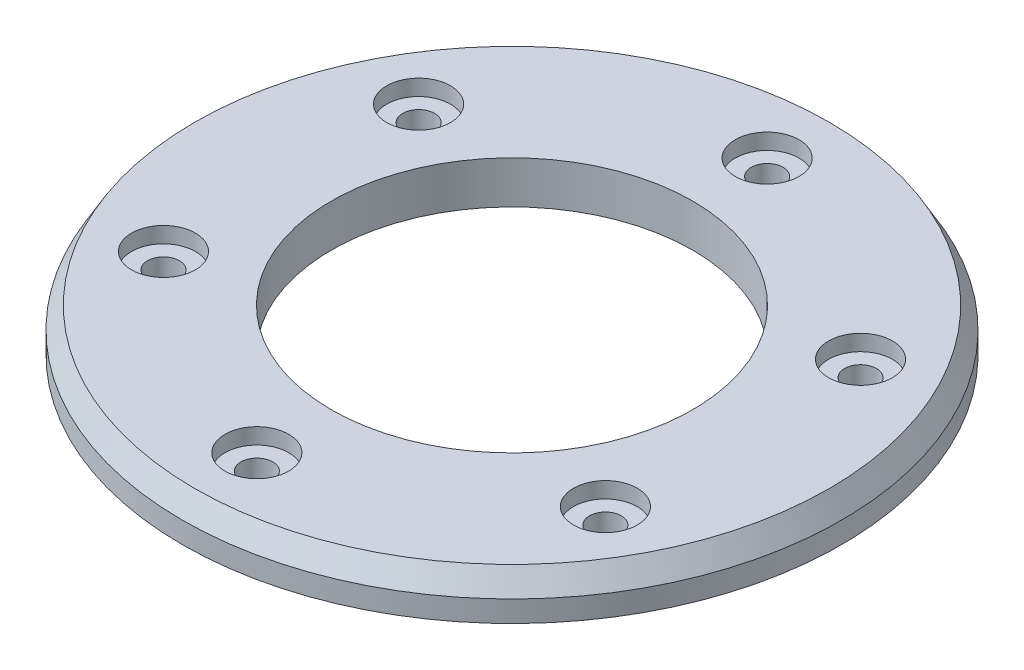
ISO-10303-21;
HEADER;
FILE_DESCRIPTION(('STEP AP214'),'2;1');
FILE_NAME('part.step','',(''),(''),'','','');
FILE_SCHEMA(('AUTOMOTIVE_DESIGN { 1 0 10303 214 1 1 1 1 }'));
ENDSEC;
DATA;
#1=APPLICATION_CONTEXT('core data for automotive mechanical design processes');
#2=APPLICATION_PROTOCOL_DEFINITION('international standard','automotive_design',2000,#1);
#3=PRODUCT_CONTEXT('',#1,'mechanical');
#4=PRODUCT('Part','Part','',(#3));
#5=PRODUCT_RELATED_PRODUCT_CATEGORY('part','',(#4));
#6=PRODUCT_DEFINITION_FORMATION('','',#4);
#7=PRODUCT_DEFINITION_CONTEXT('part definition',#1,'design');
#8=PRODUCT_DEFINITION('design','',#6,#7);
#9=PRODUCT_DEFINITION_SHAPE('','',#8);
#10=(LENGTH_UNIT() NAMED_UNIT(*) SI_UNIT(.MILLI.,.METRE.));
#11=(NAMED_UNIT(*) PLANE_ANGLE_UNIT() SI_UNIT($,.RADIAN.));
#12=(NAMED_UNIT(*) SI_UNIT($,.STERADIAN.) SOLID_ANGLE_UNIT());
#13=UNCERTAINTY_MEASURE_WITH_UNIT(LENGTH_MEASURE(1.E-05),#10,'distance_accuracy_value','');
#14=(GEOMETRIC_REPRESENTATION_CONTEXT(3) GLOBAL_UNCERTAINTY_ASSIGNED_CONTEXT((#13)) GLOBAL_UNIT_ASSIGNED_CONTEXT((#10,
#11,#12)) REPRESENTATION_CONTEXT('',''));
#15=CARTESIAN_POINT('',(0.,0.,0.));
#16=DIRECTION('',(0.,0.,1.));
#17=DIRECTION('',(1.,0.,0.));
#18=AXIS2_PLACEMENT_3D('',#15,#16,#17);
#19=CARTESIAN_POINT('',(0.,4.,-24.));
#20=DIRECTION('',(0.,-1.,0.));
#21=DIRECTION('',(0.,0.,-1.));
#22=AXIS2_PLACEMENT_3D('',#19,#20,#21);
#23=CYLINDRICAL_SURFACE('',#22,1.5);
#24=CARTESIAN_POINT('',(0.,0.,-24.));
#25=DIRECTION('',(0.,1.,0.));
#26=DIRECTION('',(0.,0.,1.));
#27=AXIS2_PLACEMENT_3D('',#24,#25,#26);
#28=CIRCLE('',#27,1.5);
#29=CARTESIAN_POINT('',(0.,0.,-22.5));
#30=VERTEX_POINT('',#29);
#31=EDGE_CURVE('E75',#30,#30,#28,.T.);
#32=ORIENTED_EDGE('',*,*,#31,.F.);
#33=EDGE_LOOP('',(#32));
#34=FACE_BOUND('',#33,.T.);
#35=CARTESIAN_POINT('',(0.,2.5,-24.));
#36=DIRECTION('',(0.,1.,0.));
#37=DIRECTION('',(0.,0.,1.));
#38=AXIS2_PLACEMENT_3D('',#35,#36,#37);
#39=CIRCLE('',#38,1.5);
#40=CARTESIAN_POINT('',(0.,2.5,-22.5));
#41=VERTEX_POINT('',#40);
#42=EDGE_CURVE('E52',#41,#41,#39,.T.);
#43=ORIENTED_EDGE('',*,*,#42,.T.);
#44=EDGE_LOOP('',(#43));
#45=FACE_BOUND('',#44,.T.);
#46=ADVANCED_FACE('F34',(#34,#45),#23,.F.);
#47=CARTESIAN_POINT('',(20.7846096908276,4.,-12.0000000000018));
#48=DIRECTION('',(0.,-1.,0.));
#49=DIRECTION('',(0.,0.,-1.));
#50=AXIS2_PLACEMENT_3D('',#47,#48,#49);
#51=CYLINDRICAL_SURFACE('',#50,1.5);
#52=CARTESIAN_POINT('',(20.7846096908276,0.,-12.0000000000018));
#53=DIRECTION('',(0.,1.,0.));
#54=DIRECTION('',(0.,0.,1.));
#55=AXIS2_PLACEMENT_3D('',#52,#53,#54);
#56=CIRCLE('',#55,1.5);
#57=CARTESIAN_POINT('',(20.7846096908276,0.,-10.5000000000018));
#58=VERTEX_POINT('',#57);
#59=EDGE_CURVE('E80',#58,#58,#56,.T.);
#60=ORIENTED_EDGE('',*,*,#59,.F.);
#61=EDGE_LOOP('',(#60));
#62=FACE_BOUND('',#61,.T.);
#63=CARTESIAN_POINT('',(20.7846096908276,2.5,-12.0000000000018));
#64=DIRECTION('',(0.,1.,0.));
#65=DIRECTION('',(0.,0.,1.));
#66=AXIS2_PLACEMENT_3D('',#63,#64,#65);
#67=CIRCLE('',#66,1.5);
#68=CARTESIAN_POINT('',(20.7846096908276,2.5,-10.5000000000018));
#69=VERTEX_POINT('',#68);
#70=EDGE_CURVE('E56',#69,#69,#67,.T.);
#71=ORIENTED_EDGE('',*,*,#70,.T.);
#72=EDGE_LOOP('',(#71));
#73=FACE_BOUND('',#72,.T.);
#74=ADVANCED_FACE('F201',(#62,#73),#51,.F.);
#75=CARTESIAN_POINT('',(20.7846096908297,4.,11.9999999999982));
#76=DIRECTION('',(0.,-1.,0.));
#77=DIRECTION('',(0.,0.,-1.));
#78=AXIS2_PLACEMENT_3D('',#75,#76,#77);
#79=CYLINDRICAL_SURFACE('',#78,1.5);
#80=CARTESIAN_POINT('',(20.7846096908297,0.,11.9999999999982));
#81=DIRECTION('',(0.,1.,0.));
#82=DIRECTION('',(0.,0.,1.));
#83=AXIS2_PLACEMENT_3D('',#80,#81,#82);
#84=CIRCLE('',#83,1.5);
#85=CARTESIAN_POINT('',(20.7846096908297,0.,13.4999999999982));
#86=VERTEX_POINT('',#85);
#87=EDGE_CURVE('E83',#86,#86,#84,.T.);
#88=ORIENTED_EDGE('',*,*,#87,.F.);
#89=EDGE_LOOP('',(#88));
#90=FACE_BOUND('',#89,.T.);
#91=CARTESIAN_POINT('',(20.7846096908297,2.5,11.9999999999982));
#92=DIRECTION('',(0.,1.,0.));
#93=DIRECTION('',(0.,0.,1.));
#94=AXIS2_PLACEMENT_3D('',#91,#92,#93);
#95=CIRCLE('',#94,1.5);
#96=CARTESIAN_POINT('',(20.7846096908297,2.5,13.4999999999982));
#97=VERTEX_POINT('',#96);
#98=EDGE_CURVE('E59',#97,#97,#95,.T.);
#99=ORIENTED_EDGE('',*,*,#98,.T.);
#100=EDGE_LOOP('',(#99));
#101=FACE_BOUND('',#100,.T.);
#102=ADVANCED_FACE('F207',(#90,#101),#79,.F.);
#103=CARTESIAN_POINT('',(4.17192928461361E-12,4.,24.));
#104=DIRECTION('',(0.,-1.,0.));
#105=DIRECTION('',(0.,0.,-1.));
#106=AXIS2_PLACEMENT_3D('',#103,#104,#105);
#107=CYLINDRICAL_SURFACE('',#106,1.5);
#108=CARTESIAN_POINT('',(4.17192928461361E-12,0.,24.));
#109=DIRECTION('',(0.,1.,0.));
#110=DIRECTION('',(0.,0.,1.));
#111=AXIS2_PLACEMENT_3D('',#108,#109,#110);
#112=CIRCLE('',#111,1.5);
#113=CARTESIAN_POINT('',(4.17192928461361E-12,0.,25.5));
#114=VERTEX_POINT('',#113);
#115=EDGE_CURVE('E86',#114,#114,#112,.T.);
#116=ORIENTED_EDGE('',*,*,#115,.F.);
#117=EDGE_LOOP('',(#116));
#118=FACE_BOUND('',#117,.T.);
#119=CARTESIAN_POINT('',(4.17192928461361E-12,2.5,24.));
#120=DIRECTION('',(0.,1.,0.));
#121=DIRECTION('',(0.,0.,1.));
#122=AXIS2_PLACEMENT_3D('',#119,#120,#121);
#123=CIRCLE('',#122,1.5);
#124=CARTESIAN_POINT('',(4.17192928461361E-12,2.5,25.5));
#125=VERTEX_POINT('',#124);
#126=EDGE_CURVE('E62',#125,#125,#123,.T.);
#127=ORIENTED_EDGE('',*,*,#126,.T.);
#128=EDGE_LOOP('',(#127));
#129=FACE_BOUND('',#128,.T.);
#130=ADVANCED_FACE('F248',(#118,#129),#107,.F.);
#131=CARTESIAN_POINT('',(-20.7846096908234,4.,12.0000000000018));
#132=DIRECTION('',(0.,-1.,0.));
#133=DIRECTION('',(0.,0.,-1.));
#134=AXIS2_PLACEMENT_3D('',#131,#132,#133);
#135=CYLINDRICAL_SURFACE('',#134,1.5);
#136=CARTESIAN_POINT('',(-20.7846096908234,0.,12.0000000000018));
#137=DIRECTION('',(0.,1.,0.));
#138=DIRECTION('',(0.,0.,1.));
#139=AXIS2_PLACEMENT_3D('',#136,#137,#138);
#140=CIRCLE('',#139,1.5);
#141=CARTESIAN_POINT('',(-20.7846096908234,0.,13.5000000000018));
#142=VERTEX_POINT('',#141);
#143=EDGE_CURVE('E89',#142,#142,#140,.T.);
#144=ORIENTED_EDGE('',*,*,#143,.F.);
#145=EDGE_LOOP('',(#144));
#146=FACE_BOUND('',#145,.T.);
#147=CARTESIAN_POINT('',(-20.7846096908234,2.5,12.0000000000018));
#148=DIRECTION('',(0.,1.,0.));
#149=DIRECTION('',(0.,0.,1.));
#150=AXIS2_PLACEMENT_3D('',#147,#148,#149);
#151=CIRCLE('',#150,1.5);
#152=CARTESIAN_POINT('',(-20.7846096908234,2.5,13.5000000000018));
#153=VERTEX_POINT('',#152);
#154=EDGE_CURVE('E65',#153,#153,#151,.T.);
#155=ORIENTED_EDGE('',*,*,#154,.T.);
#156=EDGE_LOOP('',(#155));
#157=FACE_BOUND('',#156,.T.);
#158=ADVANCED_FACE('F183',(#146,#157),#135,.F.);
#159=CARTESIAN_POINT('',(-20.7846096908255,4.,-11.9999999999982));
#160=DIRECTION('',(0.,-1.,0.));
#161=DIRECTION('',(0.,0.,-1.));
#162=AXIS2_PLACEMENT_3D('',#159,#160,#161);
#163=CYLINDRICAL_SURFACE('',#162,1.5);
#164=CARTESIAN_POINT('',(-20.7846096908255,0.,-11.9999999999982));
#165=DIRECTION('',(0.,1.,0.));
#166=DIRECTION('',(0.,0.,1.));
#167=AXIS2_PLACEMENT_3D('',#164,#165,#166);
#168=CIRCLE('',#167,1.5);
#169=CARTESIAN_POINT('',(-20.7846096908255,0.,-10.4999999999982));
#170=VERTEX_POINT('',#169);
#171=EDGE_CURVE('E55',#170,#170,#168,.T.);
#172=ORIENTED_EDGE('',*,*,#171,.F.);
#173=EDGE_LOOP('',(#172));
#174=FACE_BOUND('',#173,.T.);
#175=CARTESIAN_POINT('',(-20.7846096908255,2.5,-11.9999999999982));
#176=DIRECTION('',(0.,1.,0.));
#177=DIRECTION('',(0.,0.,1.));
#178=AXIS2_PLACEMENT_3D('',#175,#176,#177);
#179=CIRCLE('',#178,1.5);
#180=CARTESIAN_POINT('',(-20.7846096908255,2.5,-10.4999999999982));
#181=VERTEX_POINT('',#180);
#182=EDGE_CURVE('E68',#181,#181,#179,.T.);
#183=ORIENTED_EDGE('',*,*,#182,.T.);
#184=EDGE_LOOP('',(#183));
#185=FACE_BOUND('',#184,.T.);
#186=ADVANCED_FACE('F143',(#174,#185),#163,.F.);
#187=CARTESIAN_POINT('',(0.,4.,0.));
#188=DIRECTION('',(0.,1.,0.));
#189=DIRECTION('',(0.,0.,1.));
#190=AXIS2_PLACEMENT_3D('',#187,#188,#189);
#191=PLANE('',#190);
#192=CARTESIAN_POINT('',(0.,4.,0.));
#193=DIRECTION('',(0.,1.,0.));
#194=DIRECTION('',(0.,0.,1.));
#195=AXIS2_PLACEMENT_3D('',#192,#193,#194);
#196=CIRCLE('',#195,29.8452994616207);
#197=CARTESIAN_POINT('',(0.,4.,29.8452994616207));
#198=VERTEX_POINT('',#197);
#199=EDGE_CURVE('E41',#198,#198,#196,.T.);
#200=ORIENTED_EDGE('',*,*,#199,.T.);
#201=EDGE_LOOP('',(#200));
#202=FACE_BOUND('',#201,.T.);
#203=CARTESIAN_POINT('',(0.,4.,-24.));
#204=DIRECTION('',(0.,1.,0.));
#205=DIRECTION('',(0.,0.,1.));
#206=AXIS2_PLACEMENT_3D('',#203,#204,#205);
#207=CIRCLE('',#206,3.);
#208=CARTESIAN_POINT('',(0.,4.,-21.));
#209=VERTEX_POINT('',#208);
#210=EDGE_CURVE('E119',#209,#209,#207,.T.);
#211=ORIENTED_EDGE('',*,*,#210,.F.);
#212=EDGE_LOOP('',(#211));
#213=FACE_BOUND('',#212,.T.);
#214=CARTESIAN_POINT('',(-20.7846096908259,4.,-11.9999999999988));
#215=DIRECTION('',(0.,1.,0.));
#216=DIRECTION('',(0.,0.,1.));
#217=AXIS2_PLACEMENT_3D('',#214,#215,#216);
#218=CIRCLE('',#217,3.00000000000128);
#219=CARTESIAN_POINT('',(-20.7846096908259,4.,-8.99999999999753));
#220=VERTEX_POINT('',#219);
#221=EDGE_CURVE('E120',#220,#220,#218,.T.);
#222=ORIENTED_EDGE('',*,*,#221,.F.);
#223=EDGE_LOOP('',(#222));
#224=FACE_BOUND('',#223,.T.);
#225=CARTESIAN_POINT('',(-20.7846096908245,4.,12.0000000000012));
#226=DIRECTION('',(0.,1.,0.));
#227=DIRECTION('',(0.,0.,1.));
#228=AXIS2_PLACEMENT_3D('',#225,#226,#227);
#229=CIRCLE('',#228,3.00000000000251);
#230=CARTESIAN_POINT('',(-20.7846096908245,4.,15.0000000000037));
#231=VERTEX_POINT('',#230);
#232=EDGE_CURVE('E94',#231,#231,#229,.T.);
#233=ORIENTED_EDGE('',*,*,#232,.F.);
#234=EDGE_LOOP('',(#233));
#235=FACE_BOUND('',#234,.T.);
#236=CARTESIAN_POINT('',(2.72260580068288E-12,4.,24.));
#237=DIRECTION('',(0.,1.,0.));
#238=DIRECTION('',(0.,0.,1.));
#239=AXIS2_PLACEMENT_3D('',#236,#237,#238);
#240=CIRCLE('',#239,3.00000000000276);
#241=CARTESIAN_POINT('',(2.72260580068288E-12,4.,27.0000000000028));
#242=VERTEX_POINT('',#241);
#243=EDGE_CURVE('E101',#242,#242,#240,.T.);
#244=ORIENTED_EDGE('',*,*,#243,.F.);
#245=EDGE_LOOP('',(#244));
#246=FACE_BOUND('',#245,.T.);
#247=CARTESIAN_POINT('',(20.7846096908286,4.,11.9999999999988));
#248=DIRECTION('',(0.,1.,0.));
#249=DIRECTION('',(0.,0.,1.));
#250=AXIS2_PLACEMENT_3D('',#247,#248,#249);
#251=CIRCLE('',#250,3.00000000000172);
#252=CARTESIAN_POINT('',(20.7846096908286,4.,15.0000000000005));
#253=VERTEX_POINT('',#252);
#254=EDGE_CURVE('E107',#253,#253,#251,.T.);
#255=ORIENTED_EDGE('',*,*,#254,.F.);
#256=EDGE_LOOP('',(#255));
#257=FACE_BOUND('',#256,.T.);
#258=CARTESIAN_POINT('',(20.7846096908272,4.,-12.0000000000012));
#259=DIRECTION('',(0.,1.,0.));
#260=DIRECTION('',(0.,0.,1.));
#261=AXIS2_PLACEMENT_3D('',#258,#259,#260);
#262=CIRCLE('',#261,3.00000000000036);
#263=CARTESIAN_POINT('',(20.7846096908272,4.,-9.00000000000082));
#264=VERTEX_POINT('',#263);
#265=EDGE_CURVE('E113',#264,#264,#262,.T.);
#266=ORIENTED_EDGE('',*,*,#265,.F.);
#267=EDGE_LOOP('',(#266));
#268=FACE_BOUND('',#267,.T.);
#269=CARTESIAN_POINT('',(0.,4.,0.));
#270=DIRECTION('',(0.,1.,0.));
#271=DIRECTION('',(0.,0.,1.));
#272=AXIS2_PLACEMENT_3D('',#269,#270,#271);
#273=CIRCLE('',#272,17.);
#274=CARTESIAN_POINT('',(0.,4.,17.));
#275=VERTEX_POINT('',#274);
#276=EDGE_CURVE('E49',#275,#275,#273,.T.);
#277=ORIENTED_EDGE('',*,*,#276,.F.);
#278=EDGE_LOOP('',(#277));
#279=FACE_BOUND('',#278,.T.);
#280=ADVANCED_FACE('F139',(#202,#213,#224,#235,#246,#257,#268,#279),#191,.T.);
#281=CARTESIAN_POINT('',(0.,0.,0.));
#282=DIRECTION('',(0.,1.,0.));
#283=DIRECTION('',(0.,0.,1.));
#284=AXIS2_PLACEMENT_3D('',#281,#282,#283);
#285=PLANE('',#284);
#286=CARTESIAN_POINT('',(0.,0.,0.));
#287=DIRECTION('',(0.,1.,0.));
#288=DIRECTION('',(0.,0.,1.));
#289=AXIS2_PLACEMENT_3D('',#286,#287,#288);
#290=CIRCLE('',#289,31.);
#291=CARTESIAN_POINT('',(0.,0.,31.));
#292=VERTEX_POINT('',#291);
#293=EDGE_CURVE('E45',#292,#292,#290,.T.);
#294=ORIENTED_EDGE('',*,*,#293,.F.);
#295=EDGE_LOOP('',(#294));
#296=FACE_BOUND('',#295,.T.);
#297=CARTESIAN_POINT('',(0.,0.,0.));
#298=DIRECTION('',(0.,1.,0.));
#299=DIRECTION('',(0.,0.,1.));
#300=AXIS2_PLACEMENT_3D('',#297,#298,#299);
#301=CIRCLE('',#300,17.);
#302=CARTESIAN_POINT('',(0.,0.,17.));
#303=VERTEX_POINT('',#302);
#304=EDGE_CURVE('E72',#303,#303,#301,.T.);
#305=ORIENTED_EDGE('',*,*,#304,.T.);
#306=EDGE_LOOP('',(#305));
#307=FACE_BOUND('',#306,.T.);
#308=ORIENTED_EDGE('',*,*,#31,.T.);
#309=EDGE_LOOP('',(#308));
#310=FACE_BOUND('',#309,.T.);
#311=ORIENTED_EDGE('',*,*,#59,.T.);
#312=EDGE_LOOP('',(#311));
#313=FACE_BOUND('',#312,.T.);
#314=ORIENTED_EDGE('',*,*,#87,.T.);
#315=EDGE_LOOP('',(#314));
#316=FACE_BOUND('',#315,.T.);
#317=ORIENTED_EDGE('',*,*,#115,.T.);
#318=EDGE_LOOP('',(#317));
#319=FACE_BOUND('',#318,.T.);
#320=ORIENTED_EDGE('',*,*,#143,.T.);
#321=EDGE_LOOP('',(#320));
#322=FACE_BOUND('',#321,.T.);
#323=ORIENTED_EDGE('',*,*,#171,.T.);
#324=EDGE_LOOP('',(#323));
#325=FACE_BOUND('',#324,.T.);
#326=ADVANCED_FACE('F142',(#296,#307,#310,#313,#316,#319,#322,#325),#285,.F.);
#327=CARTESIAN_POINT('',(0.,4.,0.));
#328=DIRECTION('',(0.,-1.,0.));
#329=DIRECTION('',(0.,0.,-1.));
#330=AXIS2_PLACEMENT_3D('',#327,#328,#329);
#331=CYLINDRICAL_SURFACE('',#330,31.);
#332=CARTESIAN_POINT('',(0.,1.99999999999998,0.));
#333=DIRECTION('',(0.,1.,0.));
#334=DIRECTION('',(0.,0.,1.));
#335=AXIS2_PLACEMENT_3D('',#332,#333,#334);
#336=CIRCLE('',#335,31.);
#337=CARTESIAN_POINT('',(0.,1.99999999999998,31.));
#338=VERTEX_POINT('',#337);
#339=EDGE_CURVE('E10',#338,#338,#336,.F.);
#340=ORIENTED_EDGE('',*,*,#339,.T.);
#341=EDGE_LOOP('',(#340));
#342=FACE_BOUND('',#341,.T.);
#343=ORIENTED_EDGE('',*,*,#293,.T.);
#344=EDGE_LOOP('',(#343));
#345=FACE_BOUND('',#344,.T.);
#346=ADVANCED_FACE('F161',(#342,#345),#331,.T.);
#347=CARTESIAN_POINT('',(0.,4.,0.));
#348=DIRECTION('',(0.,-1.,0.));
#349=DIRECTION('',(0.,0.,-1.));
#350=AXIS2_PLACEMENT_3D('',#347,#348,#349);
#351=CYLINDRICAL_SURFACE('',#350,17.);
#352=ORIENTED_EDGE('',*,*,#276,.T.);
#353=EDGE_LOOP('',(#352));
#354=FACE_BOUND('',#353,.T.);
#355=ORIENTED_EDGE('',*,*,#304,.F.);
#356=EDGE_LOOP('',(#355));
#357=FACE_BOUND('',#356,.T.);
#358=ADVANCED_FACE('F157',(#354,#357),#351,.F.);
#359=CARTESIAN_POINT('',(-20.7846096908259,2.5,-11.9999999999988));
#360=DIRECTION('',(0.,1.,0.));
#361=DIRECTION('',(0.,0.,1.));
#362=AXIS2_PLACEMENT_3D('',#359,#360,#361);
#363=CYLINDRICAL_SURFACE('',#362,3.00000000000128);
#364=CARTESIAN_POINT('',(-20.7846096908259,2.5,-11.9999999999988));
#365=DIRECTION('',(0.,1.,0.));
#366=DIRECTION('',(0.,0.,1.));
#367=AXIS2_PLACEMENT_3D('',#364,#365,#366);
#368=CIRCLE('',#367,3.00000000000128);
#369=CARTESIAN_POINT('',(-20.7846096908259,2.5,-8.99999999999753));
#370=VERTEX_POINT('',#369);
#371=EDGE_CURVE('E98',#370,#370,#368,.T.);
#372=ORIENTED_EDGE('',*,*,#371,.F.);
#373=EDGE_LOOP('',(#372));
#374=FACE_BOUND('',#373,.T.);
#375=ORIENTED_EDGE('',*,*,#221,.T.);
#376=EDGE_LOOP('',(#375));
#377=FACE_BOUND('',#376,.T.);
#378=ADVANCED_FACE('F160',(#374,#377),#363,.F.);
#379=CARTESIAN_POINT('',(-20.7846096908259,2.5,-11.9999999999988));
#380=DIRECTION('',(0.,1.,0.));
#381=DIRECTION('',(0.,0.,1.));
#382=AXIS2_PLACEMENT_3D('',#379,#380,#381);
#383=PLANE('',#382);
#384=ORIENTED_EDGE('',*,*,#182,.F.);
#385=EDGE_LOOP('',(#384));
#386=FACE_BOUND('',#385,.T.);
#387=ORIENTED_EDGE('',*,*,#371,.T.);
#388=EDGE_LOOP('',(#387));
#389=FACE_BOUND('',#388,.T.);
#390=ADVANCED_FACE('F187',(#386,#389),#383,.T.);
#391=CARTESIAN_POINT('',(-20.7846096908245,2.5,12.0000000000012));
#392=DIRECTION('',(0.,1.,0.));
#393=DIRECTION('',(0.,0.,1.));
#394=AXIS2_PLACEMENT_3D('',#391,#392,#393);
#395=CYLINDRICAL_SURFACE('',#394,3.00000000000251);
#396=CARTESIAN_POINT('',(-20.7846096908245,2.5,12.0000000000012));
#397=DIRECTION('',(0.,1.,0.));
#398=DIRECTION('',(0.,0.,1.));
#399=AXIS2_PLACEMENT_3D('',#396,#397,#398);
#400=CIRCLE('',#399,3.00000000000251);
#401=CARTESIAN_POINT('',(-20.7846096908245,2.5,15.0000000000037));
#402=VERTEX_POINT('',#401);
#403=EDGE_CURVE('E97',#402,#402,#400,.T.);
#404=ORIENTED_EDGE('',*,*,#403,.F.);
#405=EDGE_LOOP('',(#404));
#406=FACE_BOUND('',#405,.T.);
#407=ORIENTED_EDGE('',*,*,#232,.T.);
#408=EDGE_LOOP('',(#407));
#409=FACE_BOUND('',#408,.T.);
#410=ADVANCED_FACE('F190',(#406,#409),#395,.F.);
#411=CARTESIAN_POINT('',(-20.7846096908245,2.5,12.0000000000012));
#412=DIRECTION('',(0.,1.,0.));
#413=DIRECTION('',(0.,0.,1.));
#414=AXIS2_PLACEMENT_3D('',#411,#412,#413);
#415=PLANE('',#414);
#416=ORIENTED_EDGE('',*,*,#154,.F.);
#417=EDGE_LOOP('',(#416));
#418=FACE_BOUND('',#417,.T.);
#419=ORIENTED_EDGE('',*,*,#403,.T.);
#420=EDGE_LOOP('',(#419));
#421=FACE_BOUND('',#420,.T.);
#422=ADVANCED_FACE('F289',(#418,#421),#415,.T.);
#423=CARTESIAN_POINT('',(2.72260580068288E-12,2.5,24.));
#424=DIRECTION('',(0.,1.,0.));
#425=DIRECTION('',(0.,0.,1.));
#426=AXIS2_PLACEMENT_3D('',#423,#424,#425);
#427=CYLINDRICAL_SURFACE('',#426,3.00000000000276);
#428=CARTESIAN_POINT('',(2.72260580068288E-12,2.5,24.));
#429=DIRECTION('',(0.,1.,0.));
#430=DIRECTION('',(0.,0.,1.));
#431=AXIS2_PLACEMENT_3D('',#428,#429,#430);
#432=CIRCLE('',#431,3.00000000000276);
#433=CARTESIAN_POINT('',(2.72260580068288E-12,2.5,27.0000000000028));
#434=VERTEX_POINT('',#433);
#435=EDGE_CURVE('E104',#434,#434,#432,.T.);
#436=ORIENTED_EDGE('',*,*,#435,.F.);
#437=EDGE_LOOP('',(#436));
#438=FACE_BOUND('',#437,.T.);
#439=ORIENTED_EDGE('',*,*,#243,.T.);
#440=EDGE_LOOP('',(#439));
#441=FACE_BOUND('',#440,.T.);
#442=ADVANCED_FACE('F299',(#438,#441),#427,.F.);
#443=CARTESIAN_POINT('',(2.72260580068288E-12,2.5,24.));
#444=DIRECTION('',(0.,1.,0.));
#445=DIRECTION('',(0.,0.,1.));
#446=AXIS2_PLACEMENT_3D('',#443,#444,#445);
#447=PLANE('',#446);
#448=ORIENTED_EDGE('',*,*,#126,.F.);
#449=EDGE_LOOP('',(#448));
#450=FACE_BOUND('',#449,.T.);
#451=ORIENTED_EDGE('',*,*,#435,.T.);
#452=EDGE_LOOP('',(#451));
#453=FACE_BOUND('',#452,.T.);
#454=ADVANCED_FACE('F309',(#450,#453),#447,.T.);
#455=CARTESIAN_POINT('',(20.7846096908286,2.5,11.9999999999988));
#456=DIRECTION('',(0.,1.,0.));
#457=DIRECTION('',(0.,0.,1.));
#458=AXIS2_PLACEMENT_3D('',#455,#456,#457);
#459=CYLINDRICAL_SURFACE('',#458,3.00000000000172);
#460=CARTESIAN_POINT('',(20.7846096908286,2.5,11.9999999999988));
#461=DIRECTION('',(0.,1.,0.));
#462=DIRECTION('',(0.,0.,1.));
#463=AXIS2_PLACEMENT_3D('',#460,#461,#462);
#464=CIRCLE('',#463,3.00000000000172);
#465=CARTESIAN_POINT('',(20.7846096908286,2.5,15.0000000000005));
#466=VERTEX_POINT('',#465);
#467=EDGE_CURVE('E110',#466,#466,#464,.T.);
#468=ORIENTED_EDGE('',*,*,#467,.F.);
#469=EDGE_LOOP('',(#468));
#470=FACE_BOUND('',#469,.T.);
#471=ORIENTED_EDGE('',*,*,#254,.T.);
#472=EDGE_LOOP('',(#471));
#473=FACE_BOUND('',#472,.T.);
#474=ADVANCED_FACE('F319',(#470,#473),#459,.F.);
#475=CARTESIAN_POINT('',(20.7846096908286,2.5,11.9999999999988));
#476=DIRECTION('',(0.,1.,0.));
#477=DIRECTION('',(0.,0.,1.));
#478=AXIS2_PLACEMENT_3D('',#475,#476,#477);
#479=PLANE('',#478);
#480=ORIENTED_EDGE('',*,*,#98,.F.);
#481=EDGE_LOOP('',(#480));
#482=FACE_BOUND('',#481,.T.);
#483=ORIENTED_EDGE('',*,*,#467,.T.);
#484=EDGE_LOOP('',(#483));
#485=FACE_BOUND('',#484,.T.);
#486=ADVANCED_FACE('F329',(#482,#485),#479,.T.);
#487=CARTESIAN_POINT('',(20.7846096908272,2.5,-12.0000000000012));
#488=DIRECTION('',(0.,1.,0.));
#489=DIRECTION('',(0.,0.,1.));
#490=AXIS2_PLACEMENT_3D('',#487,#488,#489);
#491=CYLINDRICAL_SURFACE('',#490,3.00000000000036);
#492=CARTESIAN_POINT('',(20.7846096908272,2.5,-12.0000000000012));
#493=DIRECTION('',(0.,1.,0.));
#494=DIRECTION('',(0.,0.,1.));
#495=AXIS2_PLACEMENT_3D('',#492,#493,#494);
#496=CIRCLE('',#495,3.00000000000036);
#497=CARTESIAN_POINT('',(20.7846096908272,2.5,-9.00000000000082));
#498=VERTEX_POINT('',#497);
#499=EDGE_CURVE('E116',#498,#498,#496,.T.);
#500=ORIENTED_EDGE('',*,*,#499,.F.);
#501=EDGE_LOOP('',(#500));
#502=FACE_BOUND('',#501,.T.);
#503=ORIENTED_EDGE('',*,*,#265,.T.);
#504=EDGE_LOOP('',(#503));
#505=FACE_BOUND('',#504,.T.);
#506=ADVANCED_FACE('F339',(#502,#505),#491,.F.);
#507=CARTESIAN_POINT('',(20.7846096908272,2.5,-12.0000000000012));
#508=DIRECTION('',(0.,1.,0.));
#509=DIRECTION('',(0.,0.,1.));
#510=AXIS2_PLACEMENT_3D('',#507,#508,#509);
#511=PLANE('',#510);
#512=ORIENTED_EDGE('',*,*,#70,.F.);
#513=EDGE_LOOP('',(#512));
#514=FACE_BOUND('',#513,.T.);
#515=ORIENTED_EDGE('',*,*,#499,.T.);
#516=EDGE_LOOP('',(#515));
#517=FACE_BOUND('',#516,.T.);
#518=ADVANCED_FACE('F135',(#514,#517),#511,.T.);
#519=CARTESIAN_POINT('',(0.,2.5,-24.));
#520=DIRECTION('',(0.,1.,0.));
#521=DIRECTION('',(0.,0.,1.));
#522=AXIS2_PLACEMENT_3D('',#519,#520,#521);
#523=CYLINDRICAL_SURFACE('',#522,3.);
#524=CARTESIAN_POINT('',(0.,2.5,-24.));
#525=DIRECTION('',(0.,1.,0.));
#526=DIRECTION('',(0.,0.,1.));
#527=AXIS2_PLACEMENT_3D('',#524,#525,#526);
#528=CIRCLE('',#527,3.);
#529=CARTESIAN_POINT('',(0.,2.5,-21.));
#530=VERTEX_POINT('',#529);
#531=EDGE_CURVE('E70',#530,#530,#528,.T.);
#532=ORIENTED_EDGE('',*,*,#531,.F.);
#533=EDGE_LOOP('',(#532));
#534=FACE_BOUND('',#533,.T.);
#535=ORIENTED_EDGE('',*,*,#210,.T.);
#536=EDGE_LOOP('',(#535));
#537=FACE_BOUND('',#536,.T.);
#538=ADVANCED_FACE('F132',(#534,#537),#523,.F.);
#539=CARTESIAN_POINT('',(0.,2.5,-24.));
#540=DIRECTION('',(0.,1.,0.));
#541=DIRECTION('',(0.,0.,1.));
#542=AXIS2_PLACEMENT_3D('',#539,#540,#541);
#543=PLANE('',#542);
#544=ORIENTED_EDGE('',*,*,#42,.F.);
#545=EDGE_LOOP('',(#544));
#546=FACE_BOUND('',#545,.T.);
#547=ORIENTED_EDGE('',*,*,#531,.T.);
#548=EDGE_LOOP('',(#547));
#549=FACE_BOUND('',#548,.T.);
#550=ADVANCED_FACE('F130',(#546,#549),#543,.T.);
#551=CARTESIAN_POINT('',(0.,4.,0.));
#552=DIRECTION('',(0.,-1.,0.));
#553=DIRECTION('',(0.,0.,-1.));
#554=AXIS2_PLACEMENT_3D('',#551,#552,#553);
#555=CONICAL_SURFACE('',#554,29.8452994616207,0.523598775598301);
#556=ORIENTED_EDGE('',*,*,#339,.F.);
#557=EDGE_LOOP('',(#556));
#558=FACE_BOUND('',#557,.T.);
#559=ORIENTED_EDGE('',*,*,#199,.F.);
#560=EDGE_LOOP('',(#559));
#561=FACE_BOUND('',#560,.T.);
#562=ADVANCED_FACE('F36',(#558,#561),#555,.T.);
#563=CLOSED_SHELL('',(#46,#74,#102,#130,#158,#186,#280,#326,#346,#358,#378,#390,#410,#422,#442,
#454,#474,#486,#506,#518,#538,#550,#562));
#564=MANIFOLD_SOLID_BREP('B2',#563);
#565=ADVANCED_BREP_SHAPE_REPRESENTATION('',(#18,#564),#14);
#566=SHAPE_DEFINITION_REPRESENTATION(#9,#565);
ENDSEC;
END-ISO-10303-21;
